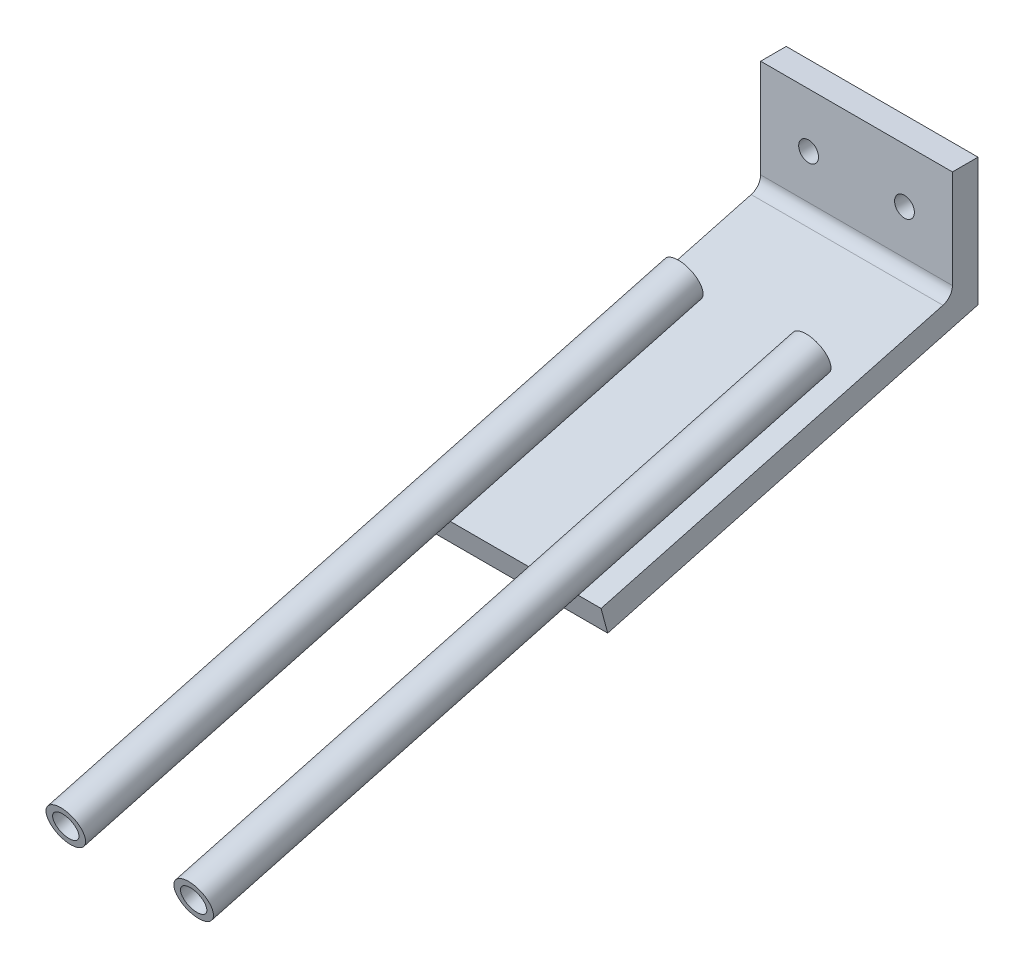
ISO-10303-21;
HEADER;
FILE_DESCRIPTION(('STEP AP214'),'2;1');
FILE_NAME('part.step','',(''),(''),'','','');
FILE_SCHEMA(('AUTOMOTIVE_DESIGN { 1 0 10303 214 1 1 1 1 }'));
ENDSEC;
DATA;
#1=APPLICATION_CONTEXT('core data for automotive mechanical design processes');
#2=APPLICATION_PROTOCOL_DEFINITION('international standard','automotive_design',2000,#1);
#3=PRODUCT_CONTEXT('',#1,'mechanical');
#4=PRODUCT('Part','Part','',(#3));
#5=PRODUCT_RELATED_PRODUCT_CATEGORY('part','',(#4));
#6=PRODUCT_DEFINITION_FORMATION('','',#4);
#7=PRODUCT_DEFINITION_CONTEXT('part definition',#1,'design');
#8=PRODUCT_DEFINITION('design','',#6,#7);
#9=PRODUCT_DEFINITION_SHAPE('','',#8);
#10=(LENGTH_UNIT() NAMED_UNIT(*) SI_UNIT(.MILLI.,.METRE.));
#11=(NAMED_UNIT(*) PLANE_ANGLE_UNIT() SI_UNIT($,.RADIAN.));
#12=(NAMED_UNIT(*) SI_UNIT($,.STERADIAN.) SOLID_ANGLE_UNIT());
#13=UNCERTAINTY_MEASURE_WITH_UNIT(LENGTH_MEASURE(1.E-05),#10,'distance_accuracy_value','');
#14=(GEOMETRIC_REPRESENTATION_CONTEXT(3) GLOBAL_UNCERTAINTY_ASSIGNED_CONTEXT((#13)) GLOBAL_UNIT_ASSIGNED_CONTEXT((#10,
#11,#12)) REPRESENTATION_CONTEXT('',''));
#15=CARTESIAN_POINT('',(0.,0.,0.));
#16=DIRECTION('',(0.,0.,1.));
#17=DIRECTION('',(1.,0.,0.));
#18=AXIS2_PLACEMENT_3D('',#15,#16,#17);
#19=CARTESIAN_POINT('',(-10.,-24.2881749289703,117.690625994133));
#20=DIRECTION('',(0.,0.258819045102518,-0.965925826289069));
#21=DIRECTION('',(0.,0.965925826289069,0.258819045102518));
#22=AXIS2_PLACEMENT_3D('',#19,#20,#21);
#23=CYLINDRICAL_SURFACE('',#22,3.);
#24=CARTESIAN_POINT('',(-10.,-24.2881749289703,117.690625994133));
#25=DIRECTION('',(0.,0.258819045102518,-0.965925826289069));
#26=DIRECTION('',(0.,0.965925826289069,0.258819045102518));
#27=AXIS2_PLACEMENT_3D('',#24,#25,#26);
#28=CIRCLE('',#27,3.);
#29=CARTESIAN_POINT('',(-10.,-21.3903974501031,118.467083129441));
#30=VERTEX_POINT('',#29);
#31=EDGE_CURVE('E67',#30,#30,#28,.T.);
#32=ORIENTED_EDGE('',*,*,#31,.T.);
#33=EDGE_LOOP('',(#32));
#34=FACE_BOUND('',#33,.T.);
#35=CARTESIAN_POINT('',(-10.,1.59372958128149,21.0980433652262));
#36=DIRECTION('',(0.,0.258819045102518,-0.965925826289069));
#37=DIRECTION('',(0.,0.965925826289069,0.258819045102518));
#38=AXIS2_PLACEMENT_3D('',#35,#36,#37);
#39=CIRCLE('',#38,3.);
#40=CARTESIAN_POINT('',(-10.,4.4915070601487,21.8745005005337));
#41=VERTEX_POINT('',#40);
#42=EDGE_CURVE('E56',#41,#41,#39,.T.);
#43=ORIENTED_EDGE('',*,*,#42,.F.);
#44=EDGE_LOOP('',(#43));
#45=FACE_BOUND('',#44,.T.);
#46=ADVANCED_FACE('F52',(#34,#45),#23,.T.);
#47=CARTESIAN_POINT('',(-10.,-24.2881749289703,117.690625994133));
#48=DIRECTION('',(0.,0.258819045102518,-0.965925826289069));
#49=DIRECTION('',(0.,0.965925826289069,0.258819045102518));
#50=AXIS2_PLACEMENT_3D('',#47,#48,#49);
#51=PLANE('',#50);
#52=CARTESIAN_POINT('',(-10.,-24.2881749289703,117.690625994133));
#53=DIRECTION('',(0.,0.258819045102518,-0.965925826289069));
#54=DIRECTION('',(0.,0.965925826289069,0.258819045102518));
#55=AXIS2_PLACEMENT_3D('',#52,#53,#54);
#56=CIRCLE('',#55,2.);
#57=CARTESIAN_POINT('',(-10.,-22.3563232763921,118.208264084338));
#58=VERTEX_POINT('',#57);
#59=EDGE_CURVE('E63',#58,#58,#56,.T.);
#60=ORIENTED_EDGE('',*,*,#59,.T.);
#61=EDGE_LOOP('',(#60));
#62=FACE_BOUND('',#61,.T.);
#63=ORIENTED_EDGE('',*,*,#31,.F.);
#64=EDGE_LOOP('',(#63));
#65=FACE_BOUND('',#64,.T.);
#66=ADVANCED_FACE('F73',(#62,#65),#51,.F.);
#67=CARTESIAN_POINT('',(-10.,-24.2881749289703,117.690625994133));
#68=DIRECTION('',(0.,0.258819045102518,-0.965925826289069));
#69=DIRECTION('',(0.,0.965925826289069,0.258819045102518));
#70=AXIS2_PLACEMENT_3D('',#67,#68,#69);
#71=CYLINDRICAL_SURFACE('',#70,2.);
#72=ORIENTED_EDGE('',*,*,#59,.F.);
#73=EDGE_LOOP('',(#72));
#74=FACE_BOUND('',#73,.T.);
#75=CARTESIAN_POINT('',(-10.,1.59372958128149,21.0980433652262));
#76=DIRECTION('',(0.,0.258819045102518,-0.965925826289069));
#77=DIRECTION('',(0.,0.965925826289069,0.258819045102518));
#78=AXIS2_PLACEMENT_3D('',#75,#76,#77);
#79=CIRCLE('',#78,2.);
#80=CARTESIAN_POINT('',(-10.,3.52558123385963,21.6156814554312));
#81=VERTEX_POINT('',#80);
#82=EDGE_CURVE('E11',#81,#81,#79,.T.);
#83=ORIENTED_EDGE('',*,*,#82,.T.);
#84=EDGE_LOOP('',(#83));
#85=FACE_BOUND('',#84,.T.);
#86=ADVANCED_FACE('F75',(#74,#85),#71,.F.);
#87=CARTESIAN_POINT('',(15.,-5.16775120274204,19.2863100495086));
#88=DIRECTION('',(0.,0.258819045102518,-0.965925826289069));
#89=DIRECTION('',(0.,0.965925826289069,0.258819045102518));
#90=AXIS2_PLACEMENT_3D('',#87,#88,#89);
#91=PLANE('',#90);
#92=ORIENTED_EDGE('',*,*,#82,.F.);
#93=EDGE_LOOP('',(#92));
#94=FACE_BOUND('',#93,.T.);
#95=ORIENTED_EDGE('',*,*,#42,.T.);
#96=EDGE_LOOP('',(#95));
#97=FACE_BOUND('',#96,.T.);
#98=ADVANCED_FACE('F54',(#94,#97),#91,.T.);
#99=CLOSED_SHELL('',(#46,#66,#86,#98));
#100=MANIFOLD_SOLID_BREP('B2',#99);
#101=CARTESIAN_POINT('',(10.,-24.2881749289703,117.690625994133));
#102=DIRECTION('',(0.,0.258819045102518,-0.965925826289069));
#103=DIRECTION('',(0.,0.965925826289069,0.258819045102518));
#104=AXIS2_PLACEMENT_3D('',#101,#102,#103);
#105=CYLINDRICAL_SURFACE('',#104,3.);
#106=CARTESIAN_POINT('',(10.,-24.2881749289703,117.690625994133));
#107=DIRECTION('',(0.,0.258819045102518,-0.965925826289069));
#108=DIRECTION('',(0.,0.965925826289069,0.258819045102518));
#109=AXIS2_PLACEMENT_3D('',#106,#107,#108);
#110=CIRCLE('',#109,3.);
#111=CARTESIAN_POINT('',(10.,-21.3903974501031,118.467083129441));
#112=VERTEX_POINT('',#111);
#113=EDGE_CURVE('E51',#112,#112,#110,.T.);
#114=ORIENTED_EDGE('',*,*,#113,.T.);
#115=EDGE_LOOP('',(#114));
#116=FACE_BOUND('',#115,.T.);
#117=CARTESIAN_POINT('',(10.,1.59372958128149,21.0980433652262));
#118=DIRECTION('',(0.,0.258819045102518,-0.965925826289069));
#119=DIRECTION('',(0.,0.965925826289069,0.258819045102518));
#120=AXIS2_PLACEMENT_3D('',#117,#118,#119);
#121=CIRCLE('',#120,3.);
#122=CARTESIAN_POINT('',(10.,4.4915070601487,21.8745005005337));
#123=VERTEX_POINT('',#122);
#124=EDGE_CURVE('E134',#123,#123,#121,.T.);
#125=ORIENTED_EDGE('',*,*,#124,.F.);
#126=EDGE_LOOP('',(#125));
#127=FACE_BOUND('',#126,.T.);
#128=ADVANCED_FACE('F124',(#116,#127),#105,.T.);
#129=CARTESIAN_POINT('',(10.,-24.2881749289703,117.690625994133));
#130=DIRECTION('',(0.,0.258819045102518,-0.965925826289069));
#131=DIRECTION('',(0.,0.965925826289069,0.258819045102518));
#132=AXIS2_PLACEMENT_3D('',#129,#130,#131);
#133=PLANE('',#132);
#134=CARTESIAN_POINT('',(10.,-24.2881749289703,117.690625994133));
#135=DIRECTION('',(0.,0.258819045102518,-0.965925826289069));
#136=DIRECTION('',(0.,0.965925826289069,0.258819045102518));
#137=AXIS2_PLACEMENT_3D('',#134,#135,#136);
#138=CIRCLE('',#137,2.);
#139=CARTESIAN_POINT('',(10.,-22.3563232763921,118.208264084338));
#140=VERTEX_POINT('',#139);
#141=EDGE_CURVE('E130',#140,#140,#138,.T.);
#142=ORIENTED_EDGE('',*,*,#141,.T.);
#143=EDGE_LOOP('',(#142));
#144=FACE_BOUND('',#143,.T.);
#145=ORIENTED_EDGE('',*,*,#113,.F.);
#146=EDGE_LOOP('',(#145));
#147=FACE_BOUND('',#146,.T.);
#148=ADVANCED_FACE('F153',(#144,#147),#133,.F.);
#149=CARTESIAN_POINT('',(10.,-24.2881749289703,117.690625994133));
#150=DIRECTION('',(0.,0.258819045102518,-0.965925826289069));
#151=DIRECTION('',(0.,0.965925826289069,0.258819045102518));
#152=AXIS2_PLACEMENT_3D('',#149,#150,#151);
#153=CYLINDRICAL_SURFACE('',#152,2.);
#154=ORIENTED_EDGE('',*,*,#141,.F.);
#155=EDGE_LOOP('',(#154));
#156=FACE_BOUND('',#155,.T.);
#157=CARTESIAN_POINT('',(10.,1.59372958128149,21.0980433652262));
#158=DIRECTION('',(0.,0.258819045102518,-0.965925826289069));
#159=DIRECTION('',(0.,0.965925826289069,0.258819045102518));
#160=AXIS2_PLACEMENT_3D('',#157,#158,#159);
#161=CIRCLE('',#160,2.);
#162=CARTESIAN_POINT('',(10.,3.52558123385963,21.6156814554312));
#163=VERTEX_POINT('',#162);
#164=EDGE_CURVE('E138',#163,#163,#161,.T.);
#165=ORIENTED_EDGE('',*,*,#164,.T.);
#166=EDGE_LOOP('',(#165));
#167=FACE_BOUND('',#166,.T.);
#168=ADVANCED_FACE('F144',(#156,#167),#153,.F.);
#169=CARTESIAN_POINT('',(15.,-5.16775120274204,19.2863100495086));
#170=DIRECTION('',(0.,0.258819045102518,-0.965925826289069));
#171=DIRECTION('',(0.,0.965925826289069,0.258819045102518));
#172=AXIS2_PLACEMENT_3D('',#169,#170,#171);
#173=PLANE('',#172);
#174=ORIENTED_EDGE('',*,*,#164,.F.);
#175=EDGE_LOOP('',(#174));
#176=FACE_BOUND('',#175,.T.);
#177=ORIENTED_EDGE('',*,*,#124,.T.);
#178=EDGE_LOOP('',(#177));
#179=FACE_BOUND('',#178,.T.);
#180=ADVANCED_FACE('F146',(#176,#179),#173,.T.);
#181=CLOSED_SHELL('',(#128,#148,#168,#180));
#182=MANIFOLD_SOLID_BREP('B6',#181);
#183=CARTESIAN_POINT('',(15.,-15.5205130068427,57.9233431010713));
#184=DIRECTION('',(0.,0.258819045102518,-0.965925826289069));
#185=DIRECTION('',(0.,0.965925826289069,0.258819045102518));
#186=AXIS2_PLACEMENT_3D('',#183,#184,#185);
#187=PLANE('',#186);
#188=DIRECTION('',(0.,-0.965925826289069,-0.258819045102518));
#189=VECTOR('',#188,1.);
#190=CARTESIAN_POINT('',(-15.,-15.5205130068427,57.9233431010713));
#191=LINE('',#190,#189);
#192=CARTESIAN_POINT('',(-15.,-11.6568097016865,58.9586192814814));
#193=VERTEX_POINT('',#192);
#194=CARTESIAN_POINT('',(-15.,-15.5205130068427,57.9233431010713));
#195=VERTEX_POINT('',#194);
#196=EDGE_CURVE('E272',#193,#195,#191,.T.);
#197=ORIENTED_EDGE('',*,*,#196,.T.);
#198=DIRECTION('',(-1.,0.,0.));
#199=VECTOR('',#198,1.);
#200=CARTESIAN_POINT('',(15.,-15.5205130068427,57.9233431010713));
#201=LINE('',#200,#199);
#202=CARTESIAN_POINT('',(15.,-15.5205130068427,57.9233431010713));
#203=VERTEX_POINT('',#202);
#204=EDGE_CURVE('E251',#203,#195,#201,.T.);
#205=ORIENTED_EDGE('',*,*,#204,.F.);
#206=DIRECTION('',(0.,-0.965925826289069,-0.258819045102518));
#207=VECTOR('',#206,1.);
#208=CARTESIAN_POINT('',(15.,-15.5205130068427,57.9233431010713));
#209=LINE('',#208,#207);
#210=CARTESIAN_POINT('',(15.,-11.6568097016865,58.9586192814814));
#211=VERTEX_POINT('',#210);
#212=EDGE_CURVE('E259',#211,#203,#209,.T.);
#213=ORIENTED_EDGE('',*,*,#212,.F.);
#214=DIRECTION('',(-1.,0.,0.));
#215=VECTOR('',#214,1.);
#216=CARTESIAN_POINT('',(15.,-11.6568097016865,58.9586192814814));
#217=LINE('',#216,#215);
#218=EDGE_CURVE('E293',#211,#193,#217,.T.);
#219=ORIENTED_EDGE('',*,*,#218,.T.);
#220=EDGE_LOOP('',(#197,#205,#213,#219));
#221=FACE_BOUND('',#220,.T.);
#222=ADVANCED_FACE('F187',(#221),#187,.F.);
#223=CARTESIAN_POINT('',(15.,0.,0.));
#224=DIRECTION('',(0.,0.965925826289069,0.258819045102518));
#225=DIRECTION('',(0.,-0.258819045102518,0.965925826289069));
#226=AXIS2_PLACEMENT_3D('',#223,#224,#225);
#227=PLANE('',#226);
#228=DIRECTION('',(0.,0.258819045102518,-0.965925826289069));
#229=VECTOR('',#228,1.);
#230=CARTESIAN_POINT('',(-15.,0.,0.));
#231=LINE('',#230,#229);
#232=CARTESIAN_POINT('',(-15.,0.,0.));
#233=VERTEX_POINT('',#232);
#234=EDGE_CURVE('E307',#195,#233,#231,.T.);
#235=ORIENTED_EDGE('',*,*,#234,.T.);
#236=DIRECTION('',(-1.,0.,0.));
#237=VECTOR('',#236,1.);
#238=CARTESIAN_POINT('',(15.,0.,0.));
#239=LINE('',#238,#237);
#240=CARTESIAN_POINT('',(15.,0.,0.));
#241=VERTEX_POINT('',#240);
#242=EDGE_CURVE('E254',#241,#233,#239,.T.);
#243=ORIENTED_EDGE('',*,*,#242,.F.);
#244=DIRECTION('',(0.,0.258819045102518,-0.965925826289069));
#245=VECTOR('',#244,1.);
#246=CARTESIAN_POINT('',(15.,0.,0.));
#247=LINE('',#246,#245);
#248=EDGE_CURVE('E247',#203,#241,#247,.T.);
#249=ORIENTED_EDGE('',*,*,#248,.F.);
#250=ORIENTED_EDGE('',*,*,#204,.T.);
#251=EDGE_LOOP('',(#235,#243,#249,#250));
#252=FACE_BOUND('',#251,.T.);
#253=ADVANCED_FACE('F249',(#252),#227,.F.);
#254=CARTESIAN_POINT('',(15.,20.,0.));
#255=DIRECTION('',(0.,0.,1.));
#256=DIRECTION('',(0.,-1.,0.));
#257=AXIS2_PLACEMENT_3D('',#254,#255,#256);
#258=PLANE('',#257);
#259=CARTESIAN_POINT('',(-7.5,11.5346539759579,0.));
#260=DIRECTION('',(0.,0.,1.));
#261=DIRECTION('',(1.,0.,0.));
#262=AXIS2_PLACEMENT_3D('',#259,#260,#261);
#263=CIRCLE('',#262,1.55);
#264=CARTESIAN_POINT('',(-5.95,11.5346539759579,0.));
#265=VERTEX_POINT('',#264);
#266=EDGE_CURVE('E312',#265,#265,#263,.T.);
#267=ORIENTED_EDGE('',*,*,#266,.T.);
#268=EDGE_LOOP('',(#267));
#269=FACE_BOUND('',#268,.T.);
#270=CARTESIAN_POINT('',(7.5,11.5346539759579,0.));
#271=DIRECTION('',(0.,0.,1.));
#272=DIRECTION('',(1.,0.,0.));
#273=AXIS2_PLACEMENT_3D('',#270,#271,#272);
#274=CIRCLE('',#273,1.55);
#275=CARTESIAN_POINT('',(9.05,11.5346539759579,0.));
#276=VERTEX_POINT('',#275);
#277=EDGE_CURVE('E323',#276,#276,#274,.T.);
#278=ORIENTED_EDGE('',*,*,#277,.T.);
#279=EDGE_LOOP('',(#278));
#280=FACE_BOUND('',#279,.T.);
#281=DIRECTION('',(0.,1.,0.));
#282=VECTOR('',#281,1.);
#283=CARTESIAN_POINT('',(-15.,20.,0.));
#284=LINE('',#283,#282);
#285=CARTESIAN_POINT('',(-15.,20.,0.));
#286=VERTEX_POINT('',#285);
#287=EDGE_CURVE('E304',#233,#286,#284,.T.);
#288=ORIENTED_EDGE('',*,*,#287,.T.);
#289=DIRECTION('',(-1.,0.,0.));
#290=VECTOR('',#289,1.);
#291=CARTESIAN_POINT('',(15.,20.,0.));
#292=LINE('',#291,#290);
#293=CARTESIAN_POINT('',(15.,20.,0.));
#294=VERTEX_POINT('',#293);
#295=EDGE_CURVE('E280',#294,#286,#292,.T.);
#296=ORIENTED_EDGE('',*,*,#295,.F.);
#297=DIRECTION('',(0.,1.,0.));
#298=VECTOR('',#297,1.);
#299=CARTESIAN_POINT('',(15.,20.,0.));
#300=LINE('',#299,#298);
#301=EDGE_CURVE('E258',#241,#294,#300,.T.);
#302=ORIENTED_EDGE('',*,*,#301,.F.);
#303=ORIENTED_EDGE('',*,*,#242,.T.);
#304=EDGE_LOOP('',(#288,#296,#302,#303));
#305=FACE_BOUND('',#304,.T.);
#306=ADVANCED_FACE('F339',(#269,#280,#305),#258,.F.);
#307=CARTESIAN_POINT('',(15.,20.,4.));
#308=DIRECTION('',(0.,-1.,0.));
#309=DIRECTION('',(0.,0.,-1.));
#310=AXIS2_PLACEMENT_3D('',#307,#308,#309);
#311=PLANE('',#310);
#312=DIRECTION('',(0.,0.,1.));
#313=VECTOR('',#312,1.);
#314=CARTESIAN_POINT('',(-15.,20.,4.));
#315=LINE('',#314,#313);
#316=CARTESIAN_POINT('',(-15.,20.,4.));
#317=VERTEX_POINT('',#316);
#318=EDGE_CURVE('E301',#286,#317,#315,.T.);
#319=ORIENTED_EDGE('',*,*,#318,.T.);
#320=DIRECTION('',(-1.,0.,0.));
#321=VECTOR('',#320,1.);
#322=CARTESIAN_POINT('',(15.,20.,4.));
#323=LINE('',#322,#321);
#324=CARTESIAN_POINT('',(15.,20.,4.));
#325=VERTEX_POINT('',#324);
#326=EDGE_CURVE('E289',#325,#317,#323,.T.);
#327=ORIENTED_EDGE('',*,*,#326,.F.);
#328=DIRECTION('',(0.,0.,1.));
#329=VECTOR('',#328,1.);
#330=CARTESIAN_POINT('',(15.,20.,4.));
#331=LINE('',#330,#329);
#332=EDGE_CURVE('E318',#294,#325,#331,.T.);
#333=ORIENTED_EDGE('',*,*,#332,.F.);
#334=ORIENTED_EDGE('',*,*,#295,.T.);
#335=EDGE_LOOP('',(#319,#327,#333,#334));
#336=FACE_BOUND('',#335,.T.);
#337=ADVANCED_FACE('F353',(#336),#311,.F.);
#338=CARTESIAN_POINT('',(15.,3.06930795191586,4.));
#339=DIRECTION('',(0.,0.,-1.));
#340=DIRECTION('',(0.,1.,0.));
#341=AXIS2_PLACEMENT_3D('',#338,#339,#340);
#342=PLANE('',#341);
#343=CARTESIAN_POINT('',(-7.5,11.5346539759579,4.));
#344=DIRECTION('',(0.,0.,1.));
#345=DIRECTION('',(1.,0.,0.));
#346=AXIS2_PLACEMENT_3D('',#343,#344,#345);
#347=CIRCLE('',#346,1.55);
#348=CARTESIAN_POINT('',(-5.95,11.5346539759579,4.));
#349=VERTEX_POINT('',#348);
#350=EDGE_CURVE('E331',#349,#349,#347,.T.);
#351=ORIENTED_EDGE('',*,*,#350,.F.);
#352=EDGE_LOOP('',(#351));
#353=FACE_BOUND('',#352,.T.);
#354=CARTESIAN_POINT('',(7.5,11.5346539759579,4.));
#355=DIRECTION('',(0.,0.,1.));
#356=DIRECTION('',(1.,0.,0.));
#357=AXIS2_PLACEMENT_3D('',#354,#355,#356);
#358=CIRCLE('',#357,1.55);
#359=CARTESIAN_POINT('',(9.05,11.5346539759579,4.));
#360=VERTEX_POINT('',#359);
#361=EDGE_CURVE('E327',#360,#360,#358,.T.);
#362=ORIENTED_EDGE('',*,*,#361,.F.);
#363=EDGE_LOOP('',(#362));
#364=FACE_BOUND('',#363,.T.);
#365=DIRECTION('',(0.,-1.,0.));
#366=VECTOR('',#365,1.);
#367=CARTESIAN_POINT('',(-15.,3.06930795191586,4.));
#368=LINE('',#367,#366);
#369=CARTESIAN_POINT('',(-15.,4.60396192787378,4.));
#370=VERTEX_POINT('',#369);
#371=EDGE_CURVE('E298',#317,#370,#368,.T.);
#372=ORIENTED_EDGE('',*,*,#371,.T.);
#373=DIRECTION('',(-1.,0.,0.));
#374=VECTOR('',#373,1.);
#375=CARTESIAN_POINT('',(15.,4.60396192787378,4.));
#376=LINE('',#375,#374);
#377=CARTESIAN_POINT('',(15.,4.60396192787378,4.));
#378=VERTEX_POINT('',#377);
#379=EDGE_CURVE('E203',#370,#378,#376,.F.);
#380=ORIENTED_EDGE('',*,*,#379,.T.);
#381=DIRECTION('',(0.,-1.,0.));
#382=VECTOR('',#381,1.);
#383=CARTESIAN_POINT('',(15.,3.06930795191586,4.));
#384=LINE('',#383,#382);
#385=EDGE_CURVE('E315',#325,#378,#384,.T.);
#386=ORIENTED_EDGE('',*,*,#385,.F.);
#387=ORIENTED_EDGE('',*,*,#326,.T.);
#388=EDGE_LOOP('',(#372,#380,#386,#387));
#389=FACE_BOUND('',#388,.T.);
#390=ADVANCED_FACE('F349',(#353,#364,#389),#342,.F.);
#391=CARTESIAN_POINT('',(15.,-11.6568097016865,58.9586192814814));
#392=DIRECTION('',(0.,-0.965925826289069,-0.258819045102518));
#393=DIRECTION('',(0.,0.258819045102518,-0.965925826289069));
#394=AXIS2_PLACEMENT_3D('',#391,#392,#393);
#395=PLANE('',#394);
#396=DIRECTION('',(0.,-0.258819045102518,0.965925826289069));
#397=VECTOR('',#396,1.);
#398=CARTESIAN_POINT('',(15.,-11.6568097016865,58.9586192814814));
#399=LINE('',#398,#397);
#400=CARTESIAN_POINT('',(15.,2.67211027529565,5.48236190979497));
#401=VERTEX_POINT('',#400);
#402=EDGE_CURVE('E264',#401,#211,#399,.T.);
#403=ORIENTED_EDGE('',*,*,#402,.F.);
#404=DIRECTION('',(-1.,0.,0.));
#405=VECTOR('',#404,1.);
#406=CARTESIAN_POINT('',(-15.,2.67211027529565,5.48236190979496));
#407=LINE('',#406,#405);
#408=CARTESIAN_POINT('',(-15.,2.67211027529565,5.48236190979497));
#409=VERTEX_POINT('',#408);
#410=EDGE_CURVE('E274',#401,#409,#407,.T.);
#411=ORIENTED_EDGE('',*,*,#410,.T.);
#412=DIRECTION('',(0.,-0.258819045102518,0.965925826289069));
#413=VECTOR('',#412,1.);
#414=CARTESIAN_POINT('',(-15.,-11.6568097016865,58.9586192814814));
#415=LINE('',#414,#413);
#416=EDGE_CURVE('E269',#409,#193,#415,.T.);
#417=ORIENTED_EDGE('',*,*,#416,.T.);
#418=ORIENTED_EDGE('',*,*,#218,.F.);
#419=EDGE_LOOP('',(#403,#411,#417,#418));
#420=FACE_BOUND('',#419,.T.);
#421=ADVANCED_FACE('F352',(#420),#395,.F.);
#422=CARTESIAN_POINT('',(15.,0.,0.));
#423=DIRECTION('',(-1.,0.,0.));
#424=DIRECTION('',(0.,0.,1.));
#425=AXIS2_PLACEMENT_3D('',#422,#423,#424);
#426=PLANE('',#425);
#427=ORIENTED_EDGE('',*,*,#212,.T.);
#428=ORIENTED_EDGE('',*,*,#248,.T.);
#429=ORIENTED_EDGE('',*,*,#301,.T.);
#430=ORIENTED_EDGE('',*,*,#332,.T.);
#431=ORIENTED_EDGE('',*,*,#385,.T.);
#432=CARTESIAN_POINT('',(15.,4.60396192787378,6.));
#433=DIRECTION('',(-1.,0.,0.));
#434=DIRECTION('',(0.,0.,1.));
#435=AXIS2_PLACEMENT_3D('',#432,#433,#434);
#436=CIRCLE('',#435,2.);
#437=EDGE_CURVE('E122',#378,#401,#436,.T.);
#438=ORIENTED_EDGE('',*,*,#437,.T.);
#439=ORIENTED_EDGE('',*,*,#402,.T.);
#440=EDGE_LOOP('',(#427,#428,#429,#430,#431,#438,#439));
#441=FACE_BOUND('',#440,.T.);
#442=ADVANCED_FACE('F262',(#441),#426,.F.);
#443=CARTESIAN_POINT('',(-15.,0.,0.));
#444=DIRECTION('',(-1.,0.,0.));
#445=DIRECTION('',(0.,0.,1.));
#446=AXIS2_PLACEMENT_3D('',#443,#444,#445);
#447=PLANE('',#446);
#448=ORIENTED_EDGE('',*,*,#196,.F.);
#449=ORIENTED_EDGE('',*,*,#416,.F.);
#450=CARTESIAN_POINT('',(-15.,4.60396192787378,6.));
#451=DIRECTION('',(-1.,0.,0.));
#452=DIRECTION('',(0.,0.,1.));
#453=AXIS2_PLACEMENT_3D('',#450,#451,#452);
#454=CIRCLE('',#453,2.);
#455=EDGE_CURVE('E196',#409,#370,#454,.F.);
#456=ORIENTED_EDGE('',*,*,#455,.T.);
#457=ORIENTED_EDGE('',*,*,#371,.F.);
#458=ORIENTED_EDGE('',*,*,#318,.F.);
#459=ORIENTED_EDGE('',*,*,#287,.F.);
#460=ORIENTED_EDGE('',*,*,#234,.F.);
#461=EDGE_LOOP('',(#448,#449,#456,#457,#458,#459,#460));
#462=FACE_BOUND('',#461,.T.);
#463=ADVANCED_FACE('F362',(#462),#447,.T.);
#464=CARTESIAN_POINT('',(7.5,11.5346539759579,0.));
#465=DIRECTION('',(0.,0.,1.));
#466=DIRECTION('',(1.,0.,0.));
#467=AXIS2_PLACEMENT_3D('',#464,#465,#466);
#468=CYLINDRICAL_SURFACE('',#467,1.55);
#469=ORIENTED_EDGE('',*,*,#277,.F.);
#470=EDGE_LOOP('',(#469));
#471=FACE_BOUND('',#470,.T.);
#472=ORIENTED_EDGE('',*,*,#361,.T.);
#473=EDGE_LOOP('',(#472));
#474=FACE_BOUND('',#473,.T.);
#475=ADVANCED_FACE('F345',(#471,#474),#468,.F.);
#476=CARTESIAN_POINT('',(-7.5,11.5346539759579,0.));
#477=DIRECTION('',(0.,0.,1.));
#478=DIRECTION('',(1.,0.,0.));
#479=AXIS2_PLACEMENT_3D('',#476,#477,#478);
#480=CYLINDRICAL_SURFACE('',#479,1.55);
#481=ORIENTED_EDGE('',*,*,#266,.F.);
#482=EDGE_LOOP('',(#481));
#483=FACE_BOUND('',#482,.T.);
#484=ORIENTED_EDGE('',*,*,#350,.T.);
#485=EDGE_LOOP('',(#484));
#486=FACE_BOUND('',#485,.T.);
#487=ADVANCED_FACE('F342',(#483,#486),#480,.F.);
#488=CARTESIAN_POINT('',(15.,4.60396192787378,6.));
#489=DIRECTION('',(1.,0.,0.));
#490=DIRECTION('',(0.,0.,-1.));
#491=AXIS2_PLACEMENT_3D('',#488,#489,#490);
#492=CYLINDRICAL_SURFACE('',#491,2.);
#493=ORIENTED_EDGE('',*,*,#437,.F.);
#494=ORIENTED_EDGE('',*,*,#379,.F.);
#495=ORIENTED_EDGE('',*,*,#455,.F.);
#496=ORIENTED_EDGE('',*,*,#410,.F.);
#497=EDGE_LOOP('',(#493,#494,#495,#496));
#498=FACE_BOUND('',#497,.T.);
#499=ADVANCED_FACE('F189',(#498),#492,.F.);
#500=CLOSED_SHELL('',(#222,#253,#306,#337,#390,#421,#442,#463,#475,#487,#499));
#501=MANIFOLD_SOLID_BREP('B46',#500);
#502=ADVANCED_BREP_SHAPE_REPRESENTATION('',(#18,#100,#182,#501),#14);
#503=SHAPE_DEFINITION_REPRESENTATION(#9,#502);
ENDSEC;
END-ISO-10303-21;
